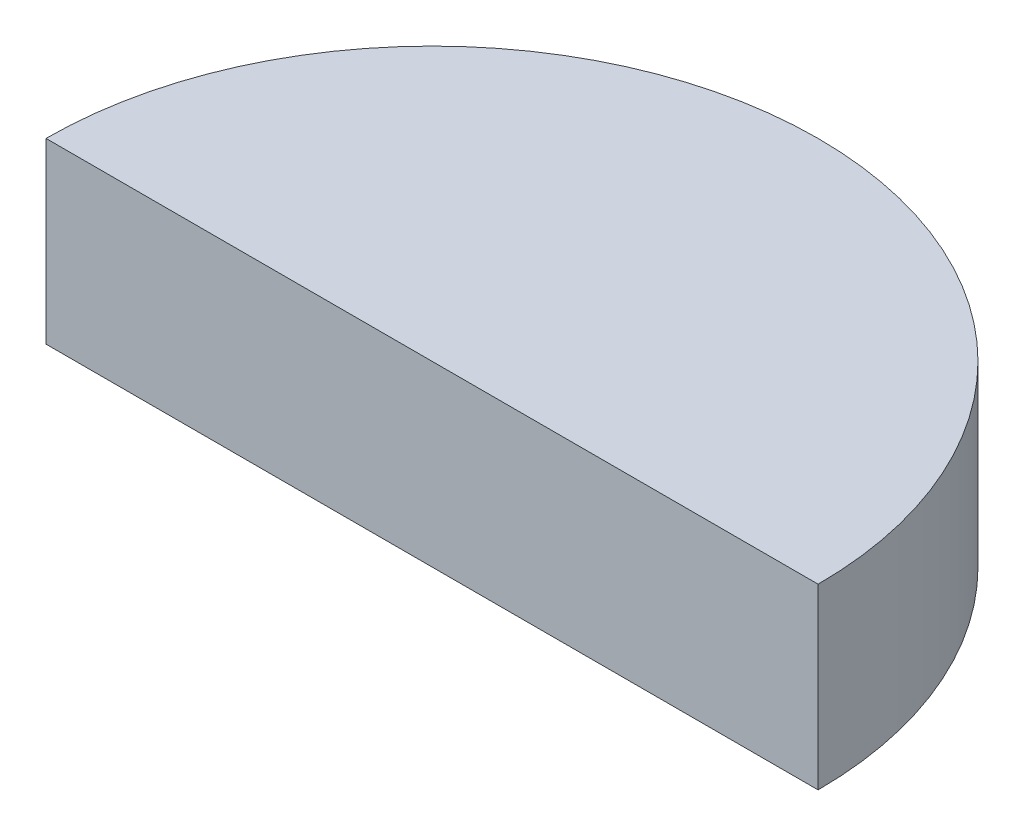
ISO-10303-21;
HEADER;
FILE_DESCRIPTION(('STEP AP214'),'2;1');
FILE_NAME('part.step','',(''),(''),'','','');
FILE_SCHEMA(('AUTOMOTIVE_DESIGN { 1 0 10303 214 1 1 1 1 }'));
ENDSEC;
DATA;
#1=APPLICATION_CONTEXT('core data for automotive mechanical design processes');
#2=APPLICATION_PROTOCOL_DEFINITION('international standard','automotive_design',2000,#1);
#3=PRODUCT_CONTEXT('',#1,'mechanical');
#4=PRODUCT('Part','Part','',(#3));
#5=PRODUCT_RELATED_PRODUCT_CATEGORY('part','',(#4));
#6=PRODUCT_DEFINITION_FORMATION('','',#4);
#7=PRODUCT_DEFINITION_CONTEXT('part definition',#1,'design');
#8=PRODUCT_DEFINITION('design','',#6,#7);
#9=PRODUCT_DEFINITION_SHAPE('','',#8);
#10=(LENGTH_UNIT() NAMED_UNIT(*) SI_UNIT(.MILLI.,.METRE.));
#11=(NAMED_UNIT(*) PLANE_ANGLE_UNIT() SI_UNIT($,.RADIAN.));
#12=(NAMED_UNIT(*) SI_UNIT($,.STERADIAN.) SOLID_ANGLE_UNIT());
#13=UNCERTAINTY_MEASURE_WITH_UNIT(LENGTH_MEASURE(1.E-05),#10,'distance_accuracy_value','');
#14=(GEOMETRIC_REPRESENTATION_CONTEXT(3) GLOBAL_UNCERTAINTY_ASSIGNED_CONTEXT((#13)) GLOBAL_UNIT_ASSIGNED_CONTEXT((#10,
#11,#12)) REPRESENTATION_CONTEXT('',''));
#15=CARTESIAN_POINT('',(0.,0.,0.));
#16=DIRECTION('',(0.,0.,1.));
#17=DIRECTION('',(1.,0.,0.));
#18=AXIS2_PLACEMENT_3D('',#15,#16,#17);
#19=CARTESIAN_POINT('',(0.,6.,0.));
#20=DIRECTION('',(0.,-1.,0.));
#21=DIRECTION('',(0.,0.,-1.));
#22=AXIS2_PLACEMENT_3D('',#19,#20,#21);
#23=CYLINDRICAL_SURFACE('',#22,13.);
#24=CARTESIAN_POINT('',(0.,0.,0.));
#25=DIRECTION('',(0.,1.,0.));
#26=DIRECTION('',(0.,0.,1.));
#27=AXIS2_PLACEMENT_3D('',#24,#25,#26);
#28=CIRCLE('',#27,13.);
#29=CARTESIAN_POINT('',(13.,0.,0.));
#30=VERTEX_POINT('',#29);
#31=CARTESIAN_POINT('',(-13.,0.,0.));
#32=VERTEX_POINT('',#31);
#33=EDGE_CURVE('E72',#30,#32,#28,.T.);
#34=ORIENTED_EDGE('',*,*,#33,.T.);
#35=DIRECTION('',(0.,-1.,0.));
#36=VECTOR('',#35,1.);
#37=CARTESIAN_POINT('',(-13.,6.,0.));
#38=LINE('',#37,#36);
#39=CARTESIAN_POINT('',(-13.,6.,0.));
#40=VERTEX_POINT('',#39);
#41=EDGE_CURVE('E11',#40,#32,#38,.T.);
#42=ORIENTED_EDGE('',*,*,#41,.F.);
#43=CARTESIAN_POINT('',(0.,6.,0.));
#44=DIRECTION('',(0.,1.,0.));
#45=DIRECTION('',(0.,0.,1.));
#46=AXIS2_PLACEMENT_3D('',#43,#44,#45);
#47=CIRCLE('',#46,13.);
#48=CARTESIAN_POINT('',(13.,6.,0.));
#49=VERTEX_POINT('',#48);
#50=EDGE_CURVE('E71',#49,#40,#47,.T.);
#51=ORIENTED_EDGE('',*,*,#50,.F.);
#52=DIRECTION('',(0.,-1.,0.));
#53=VECTOR('',#52,1.);
#54=CARTESIAN_POINT('',(13.,6.,0.));
#55=LINE('',#54,#53);
#56=EDGE_CURVE('E48',#49,#30,#55,.T.);
#57=ORIENTED_EDGE('',*,*,#56,.T.);
#58=EDGE_LOOP('',(#34,#42,#51,#57));
#59=FACE_BOUND('',#58,.T.);
#60=ADVANCED_FACE('F39',(#59),#23,.T.);
#61=CARTESIAN_POINT('',(-13.,6.,0.));
#62=DIRECTION('',(0.,0.,-1.));
#63=DIRECTION('',(-1.,0.,0.));
#64=AXIS2_PLACEMENT_3D('',#61,#62,#63);
#65=PLANE('',#64);
#66=DIRECTION('',(1.,0.,0.));
#67=VECTOR('',#66,1.);
#68=CARTESIAN_POINT('',(-13.,0.,0.));
#69=LINE('',#68,#67);
#70=EDGE_CURVE('E63',#32,#30,#69,.T.);
#71=ORIENTED_EDGE('',*,*,#70,.T.);
#72=ORIENTED_EDGE('',*,*,#56,.F.);
#73=DIRECTION('',(1.,0.,0.));
#74=VECTOR('',#73,1.);
#75=CARTESIAN_POINT('',(-13.,6.,0.));
#76=LINE('',#75,#74);
#77=EDGE_CURVE('E55',#40,#49,#76,.T.);
#78=ORIENTED_EDGE('',*,*,#77,.F.);
#79=ORIENTED_EDGE('',*,*,#41,.T.);
#80=EDGE_LOOP('',(#71,#72,#78,#79));
#81=FACE_BOUND('',#80,.T.);
#82=ADVANCED_FACE('F66',(#81),#65,.F.);
#83=CARTESIAN_POINT('',(0.,6.,0.));
#84=DIRECTION('',(0.,1.,0.));
#85=DIRECTION('',(0.,0.,1.));
#86=AXIS2_PLACEMENT_3D('',#83,#84,#85);
#87=PLANE('',#86);
#88=ORIENTED_EDGE('',*,*,#50,.T.);
#89=ORIENTED_EDGE('',*,*,#77,.T.);
#90=EDGE_LOOP('',(#88,#89));
#91=FACE_BOUND('',#90,.T.);
#92=ADVANCED_FACE('F83',(#91),#87,.T.);
#93=CARTESIAN_POINT('',(0.,0.,0.));
#94=DIRECTION('',(0.,1.,0.));
#95=DIRECTION('',(0.,0.,1.));
#96=AXIS2_PLACEMENT_3D('',#93,#94,#95);
#97=PLANE('',#96);
#98=ORIENTED_EDGE('',*,*,#33,.F.);
#99=ORIENTED_EDGE('',*,*,#70,.F.);
#100=EDGE_LOOP('',(#98,#99));
#101=FACE_BOUND('',#100,.T.);
#102=ADVANCED_FACE('F76',(#101),#97,.F.);
#103=CLOSED_SHELL('',(#60,#82,#92,#102));
#104=MANIFOLD_SOLID_BREP('B2',#103);
#105=ADVANCED_BREP_SHAPE_REPRESENTATION('',(#18,#104),#14);
#106=SHAPE_DEFINITION_REPRESENTATION(#9,#105);
ENDSEC;
END-ISO-10303-21;
